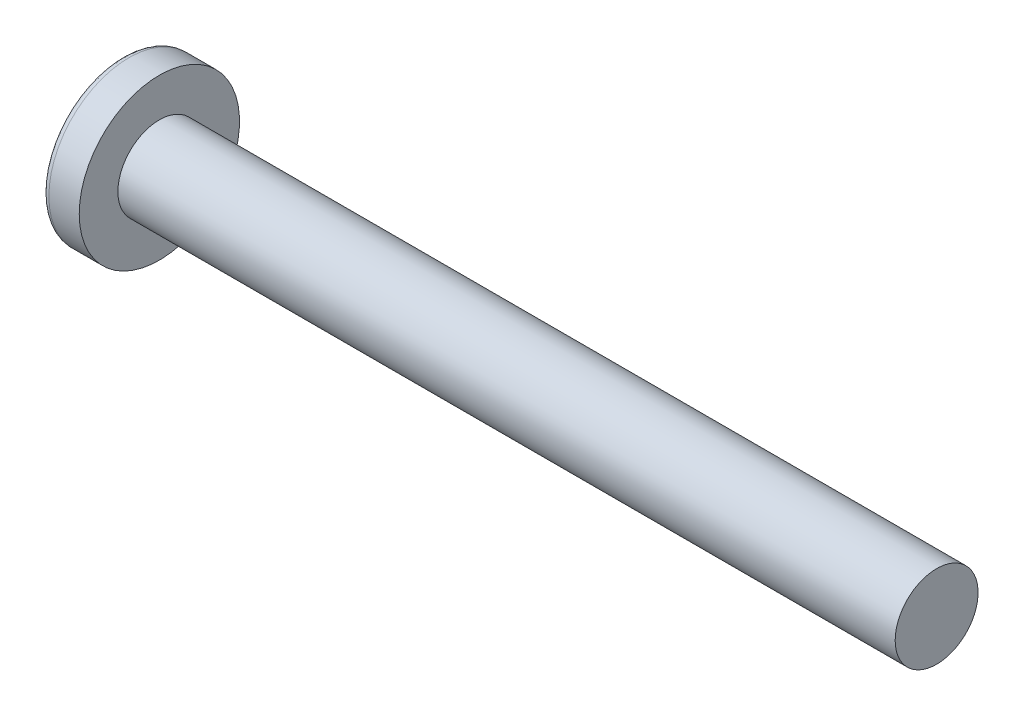
ISO-10303-21;
HEADER;
FILE_DESCRIPTION(('STEP AP214'),'2;1');
FILE_NAME('part.step','',(''),(''),'','','');
FILE_SCHEMA(('AUTOMOTIVE_DESIGN { 1 0 10303 214 1 1 1 1 }'));
ENDSEC;
DATA;
#1=APPLICATION_CONTEXT('core data for automotive mechanical design processes');
#2=APPLICATION_PROTOCOL_DEFINITION('international standard','automotive_design',2000,#1);
#3=PRODUCT_CONTEXT('',#1,'mechanical');
#4=PRODUCT('Part','Part','',(#3));
#5=PRODUCT_RELATED_PRODUCT_CATEGORY('part','',(#4));
#6=PRODUCT_DEFINITION_FORMATION('','',#4);
#7=PRODUCT_DEFINITION_CONTEXT('part definition',#1,'design');
#8=PRODUCT_DEFINITION('design','',#6,#7);
#9=PRODUCT_DEFINITION_SHAPE('','',#8);
#10=(LENGTH_UNIT() NAMED_UNIT(*) SI_UNIT(.MILLI.,.METRE.));
#11=(NAMED_UNIT(*) PLANE_ANGLE_UNIT() SI_UNIT($,.RADIAN.));
#12=(NAMED_UNIT(*) SI_UNIT($,.STERADIAN.) SOLID_ANGLE_UNIT());
#13=UNCERTAINTY_MEASURE_WITH_UNIT(LENGTH_MEASURE(1.E-05),#10,'distance_accuracy_value','');
#14=(GEOMETRIC_REPRESENTATION_CONTEXT(3) GLOBAL_UNCERTAINTY_ASSIGNED_CONTEXT((#13)) GLOBAL_UNIT_ASSIGNED_CONTEXT((#10,
#11,#12)) REPRESENTATION_CONTEXT('',''));
#15=CARTESIAN_POINT('',(0.,0.,0.));
#16=DIRECTION('',(0.,0.,1.));
#17=DIRECTION('',(1.,0.,0.));
#18=AXIS2_PLACEMENT_3D('',#15,#16,#17);
#19=CARTESIAN_POINT('',(2.4384,0.,0.));
#20=DIRECTION('',(-1.,0.,0.));
#21=DIRECTION('',(0.,1.,0.));
#22=AXIS2_PLACEMENT_3D('',#19,#20,#21);
#23=SPHERICAL_SURFACE('',#22,2.4384);
#24=CARTESIAN_POINT('',(0.456249612548632,0.,0.));
#25=DIRECTION('',(-1.,0.,0.));
#26=DIRECTION('',(0.,0.,1.));
#27=AXIS2_PLACEMENT_3D('',#24,#25,#26);
#28=CIRCLE('',#27,1.42016703296703);
#29=CARTESIAN_POINT('',(0.456249612548632,0.,1.42016703296703));
#30=VERTEX_POINT('',#29);
#31=EDGE_CURVE('E152',#30,#30,#28,.T.);
#32=ORIENTED_EDGE('',*,*,#31,.T.);
#33=EDGE_LOOP('',(#32));
#34=FACE_BOUND('',#33,.T.);
#35=CARTESIAN_POINT('',(2.42797639477701,-0.0720176360861456,0.));
#36=DIRECTION('',(-0.14324422473273,-0.989687370880683,0.));
#37=DIRECTION('',(0.989687370880683,-0.14324422473273,0.));
#38=AXIS2_PLACEMENT_3D('',#35,#36,#37);
#39=CIRCLE('',#38,2.43731396593601);
#40=CARTESIAN_POINT('',(0.159528631296444,0.256310329680775,0.828761039022779));
#41=VERTEX_POINT('',#40);
#42=CARTESIAN_POINT('',(0.0311879238102928,0.274885958395878,0.274885958395878));
#43=VERTEX_POINT('',#42);
#44=EDGE_CURVE('E183',#41,#43,#39,.T.);
#45=ORIENTED_EDGE('',*,*,#44,.F.);
#46=CARTESIAN_POINT('',(1.8850401359864,0.,-0.647005379462054));
#47=DIRECTION('',(0.649967502437297,0.,0.759962002849762));
#48=DIRECTION('',(0.759962002849762,0.,-0.649967502437297));
#49=AXIS2_PLACEMENT_3D('',#46,#47,#48);
#50=CIRCLE('',#49,2.28494452008052);
#51=CARTESIAN_POINT('',(0.159528631296444,-0.25631032968078,0.828761039022778));
#52=VERTEX_POINT('',#51);
#53=EDGE_CURVE('E148',#41,#52,#50,.T.);
#54=ORIENTED_EDGE('',*,*,#53,.T.);
#55=CARTESIAN_POINT('',(2.42797639477701,0.0720176360861442,0.));
#56=DIRECTION('',(-0.14324422473273,0.989687370880683,0.));
#57=DIRECTION('',(-0.989687370880683,-0.14324422473273,0.));
#58=AXIS2_PLACEMENT_3D('',#55,#56,#57);
#59=CIRCLE('',#58,2.43731396593601);
#60=CARTESIAN_POINT('',(0.0311879238102924,-0.274885958395879,0.274885958395878));
#61=VERTEX_POINT('',#60);
#62=EDGE_CURVE('E104',#61,#52,#59,.T.);
#63=ORIENTED_EDGE('',*,*,#62,.F.);
#64=CARTESIAN_POINT('',(2.42797639477701,0.,-0.0720176360861442));
#65=DIRECTION('',(-0.14324422473273,0.,-0.989687370880683));
#66=DIRECTION('',(-0.989687370880683,0.,0.14324422473273));
#67=AXIS2_PLACEMENT_3D('',#64,#65,#66);
#68=CIRCLE('',#67,2.43731396593601);
#69=CARTESIAN_POINT('',(0.159528631296443,-0.828761039022779,0.256310329680777));
#70=VERTEX_POINT('',#69);
#71=EDGE_CURVE('E129',#70,#61,#68,.T.);
#72=ORIENTED_EDGE('',*,*,#71,.F.);
#73=CARTESIAN_POINT('',(1.8850401359864,0.647005379462053,0.));
#74=DIRECTION('',(0.649967502437297,-0.759962002849762,0.));
#75=DIRECTION('',(0.759962002849762,0.649967502437297,0.));
#76=AXIS2_PLACEMENT_3D('',#73,#74,#75);
#77=CIRCLE('',#76,2.28494452008052);
#78=CARTESIAN_POINT('',(0.159528631296443,-0.828761039022779,-0.256310329680778));
#79=VERTEX_POINT('',#78);
#80=EDGE_CURVE('E137',#70,#79,#77,.T.);
#81=ORIENTED_EDGE('',*,*,#80,.T.);
#82=CARTESIAN_POINT('',(2.42797639477701,0.,0.0720176360861456));
#83=DIRECTION('',(-0.14324422473273,0.,0.989687370880683));
#84=DIRECTION('',(0.989687370880683,0.,0.14324422473273));
#85=AXIS2_PLACEMENT_3D('',#82,#83,#84);
#86=CIRCLE('',#85,2.43731396593601);
#87=CARTESIAN_POINT('',(0.0311879238102919,-0.274885958395877,-0.274885958395879));
#88=VERTEX_POINT('',#87);
#89=EDGE_CURVE('E47',#88,#79,#86,.T.);
#90=ORIENTED_EDGE('',*,*,#89,.F.);
#91=CARTESIAN_POINT('',(0.159528631296444,-0.256310329680774,-0.828761039022779));
#92=VERTEX_POINT('',#91);
#93=EDGE_CURVE('E190',#92,#88,#59,.T.);
#94=ORIENTED_EDGE('',*,*,#93,.F.);
#95=CARTESIAN_POINT('',(1.8850401359864,0.,0.647005379462054));
#96=DIRECTION('',(0.649967502437297,0.,-0.759962002849762));
#97=DIRECTION('',(-0.759962002849762,0.,-0.649967502437297));
#98=AXIS2_PLACEMENT_3D('',#95,#96,#97);
#99=CIRCLE('',#98,2.28494452008052);
#100=CARTESIAN_POINT('',(0.159528631296444,0.256310329680781,-0.828761039022777));
#101=VERTEX_POINT('',#100);
#102=EDGE_CURVE('E130',#92,#101,#99,.T.);
#103=ORIENTED_EDGE('',*,*,#102,.T.);
#104=CARTESIAN_POINT('',(0.0311879238102928,0.27488595839588,-0.274885958395879));
#105=VERTEX_POINT('',#104);
#106=EDGE_CURVE('E178',#105,#101,#39,.T.);
#107=ORIENTED_EDGE('',*,*,#106,.F.);
#108=CARTESIAN_POINT('',(0.159528631296445,0.828761039022778,-0.256310329680778));
#109=VERTEX_POINT('',#108);
#110=EDGE_CURVE('E40',#109,#105,#86,.T.);
#111=ORIENTED_EDGE('',*,*,#110,.F.);
#112=CARTESIAN_POINT('',(1.8850401359864,-0.647005379462055,0.));
#113=DIRECTION('',(0.649967502437297,0.759962002849762,0.));
#114=DIRECTION('',(-0.759962002849762,0.649967502437297,0.));
#115=AXIS2_PLACEMENT_3D('',#112,#113,#114);
#116=CIRCLE('',#115,2.28494452008053);
#117=CARTESIAN_POINT('',(0.159528631296444,0.828761039022778,0.256310329680777));
#118=VERTEX_POINT('',#117);
#119=EDGE_CURVE('E11',#109,#118,#116,.T.);
#120=ORIENTED_EDGE('',*,*,#119,.T.);
#121=EDGE_CURVE('E166',#43,#118,#68,.T.);
#122=ORIENTED_EDGE('',*,*,#121,.F.);
#123=EDGE_LOOP('',(#45,#54,#63,#72,#81,#90,#94,#103,#107,#111,#120,#122));
#124=FACE_BOUND('',#123,.T.);
#125=ADVANCED_FACE('F32',(#34,#124),#23,.T.);
#126=CARTESIAN_POINT('',(1.12854153846154,0.,-0.116058461538462));
#127=DIRECTION('',(-0.14324422473273,0.,0.989687370880683));
#128=DIRECTION('',(0.989687370880683,0.,0.14324422473273));
#129=AXIS2_PLACEMENT_3D('',#126,#127,#128);
#130=PLANE('',#129);
#131=ORIENTED_EDGE('',*,*,#110,.T.);
#132=DIRECTION('',(0.979687350511585,-0.141796853363519,0.141796853363519));
#133=VECTOR('',#132,1.);
#134=CARTESIAN_POINT('',(1.14466398343431,0.113724949766087,-0.113724949766086));
#135=LINE('',#134,#133);
#136=CARTESIAN_POINT('',(0.9652,0.1397,-0.139699999999999));
#137=VERTEX_POINT('',#136);
#138=EDGE_CURVE('E172',#105,#137,#135,.T.);
#139=ORIENTED_EDGE('',*,*,#138,.T.);
#140=DIRECTION('',(0.755405992689852,-0.646070914800531,0.109335077889321));
#141=VECTOR('',#140,1.);
#142=CARTESIAN_POINT('',(0.,0.9652,-0.2794));
#143=LINE('',#142,#141);
#144=EDGE_CURVE('E153',#109,#137,#143,.T.);
#145=ORIENTED_EDGE('',*,*,#144,.F.);
#146=EDGE_LOOP('',(#131,#139,#145));
#147=FACE_BOUND('',#146,.T.);
#148=ADVANCED_FACE('F171',(#147),#130,.T.);
#149=DIRECTION('',(0.755405992689852,0.646070914800531,0.109335077889321));
#150=VECTOR('',#149,1.);
#151=CARTESIAN_POINT('',(0.,-0.9652,-0.2794));
#152=LINE('',#151,#150);
#153=CARTESIAN_POINT('',(0.9652,-0.1397,-0.1397));
#154=VERTEX_POINT('',#153);
#155=EDGE_CURVE('E138',#79,#154,#152,.T.);
#156=ORIENTED_EDGE('',*,*,#155,.T.);
#157=DIRECTION('',(-0.979687350511585,-0.141796853363517,-0.141796853363519));
#158=VECTOR('',#157,1.);
#159=CARTESIAN_POINT('',(1.14466398343431,-0.113724949766086,-0.113724949766086));
#160=LINE('',#159,#158);
#161=EDGE_CURVE('E193',#154,#88,#160,.T.);
#162=ORIENTED_EDGE('',*,*,#161,.T.);
#163=ORIENTED_EDGE('',*,*,#89,.T.);
#164=EDGE_LOOP('',(#156,#162,#163));
#165=FACE_BOUND('',#164,.T.);
#166=ADVANCED_FACE('F208',(#165),#130,.T.);
#167=CARTESIAN_POINT('',(1.12854153846154,0.,0.116058461538462));
#168=DIRECTION('',(-0.14324422473273,0.,-0.989687370880683));
#169=DIRECTION('',(-0.989687370880683,0.,0.14324422473273));
#170=AXIS2_PLACEMENT_3D('',#167,#168,#169);
#171=PLANE('',#170);
#172=DIRECTION('',(0.755405992689852,-0.646070914800532,-0.10933507788932));
#173=VECTOR('',#172,1.);
#174=CARTESIAN_POINT('',(0.,0.9652,0.279399999999999));
#175=LINE('',#174,#173);
#176=CARTESIAN_POINT('',(0.9652,0.1397,0.1397));
#177=VERTEX_POINT('',#176);
#178=EDGE_CURVE('E209',#118,#177,#175,.T.);
#179=ORIENTED_EDGE('',*,*,#178,.T.);
#180=DIRECTION('',(-0.979687350511585,0.141796853363518,0.141796853363518));
#181=VECTOR('',#180,1.);
#182=CARTESIAN_POINT('',(1.14466398343431,0.113724949766086,0.113724949766086));
#183=LINE('',#182,#181);
#184=EDGE_CURVE('E187',#177,#43,#183,.T.);
#185=ORIENTED_EDGE('',*,*,#184,.T.);
#186=ORIENTED_EDGE('',*,*,#121,.T.);
#187=EDGE_LOOP('',(#179,#185,#186));
#188=FACE_BOUND('',#187,.T.);
#189=ADVANCED_FACE('F213',(#188),#171,.T.);
#190=ORIENTED_EDGE('',*,*,#71,.T.);
#191=DIRECTION('',(0.979687350511585,0.141796853363518,-0.141796853363518));
#192=VECTOR('',#191,1.);
#193=CARTESIAN_POINT('',(1.14466398343431,-0.113724949766087,0.113724949766086));
#194=LINE('',#193,#192);
#195=CARTESIAN_POINT('',(0.9652,-0.1397,0.139699999999999));
#196=VERTEX_POINT('',#195);
#197=EDGE_CURVE('E102',#61,#196,#194,.T.);
#198=ORIENTED_EDGE('',*,*,#197,.T.);
#199=DIRECTION('',(0.755405992689852,0.646070914800531,-0.10933507788932));
#200=VECTOR('',#199,1.);
#201=CARTESIAN_POINT('',(0.,-0.9652,0.279399999999999));
#202=LINE('',#201,#200);
#203=EDGE_CURVE('E127',#70,#196,#202,.T.);
#204=ORIENTED_EDGE('',*,*,#203,.F.);
#205=EDGE_LOOP('',(#190,#198,#204));
#206=FACE_BOUND('',#205,.T.);
#207=ADVANCED_FACE('F126',(#206),#171,.T.);
#208=CARTESIAN_POINT('',(-25.4,0.,0.));
#209=DIRECTION('',(-1.,0.,0.));
#210=DIRECTION('',(0.,0.,1.));
#211=AXIS2_PLACEMENT_3D('',#208,#209,#210);
#212=CYLINDRICAL_SURFACE('',#211,0.762);
#213=CARTESIAN_POINT('',(15.4051,0.,0.));
#214=DIRECTION('',(-1.,0.,0.));
#215=DIRECTION('',(0.,0.,1.));
#216=AXIS2_PLACEMENT_3D('',#213,#214,#215);
#217=CIRCLE('',#216,0.762);
#218=CARTESIAN_POINT('',(15.4051,0.,0.762));
#219=VERTEX_POINT('',#218);
#220=EDGE_CURVE('E149',#219,#219,#217,.T.);
#221=ORIENTED_EDGE('',*,*,#220,.T.);
#222=EDGE_LOOP('',(#221));
#223=FACE_BOUND('',#222,.T.);
#224=CARTESIAN_POINT('',(1.1176,0.,0.));
#225=DIRECTION('',(-1.,0.,0.));
#226=DIRECTION('',(0.,0.,1.));
#227=AXIS2_PLACEMENT_3D('',#224,#225,#226);
#228=CIRCLE('',#227,0.762);
#229=CARTESIAN_POINT('',(1.1176,0.,0.762));
#230=VERTEX_POINT('',#229);
#231=EDGE_CURVE('E162',#230,#230,#228,.T.);
#232=ORIENTED_EDGE('',*,*,#231,.F.);
#233=EDGE_LOOP('',(#232));
#234=FACE_BOUND('',#233,.T.);
#235=ADVANCED_FACE('F34',(#223,#234),#212,.T.);
#236=CARTESIAN_POINT('',(1.1176,0.762,0.));
#237=DIRECTION('',(-1.,0.,0.));
#238=DIRECTION('',(0.,0.,1.));
#239=AXIS2_PLACEMENT_3D('',#236,#237,#238);
#240=PLANE('',#239);
#241=CARTESIAN_POINT('',(1.1176,0.,0.));
#242=DIRECTION('',(-1.,0.,0.));
#243=DIRECTION('',(0.,0.,1.));
#244=AXIS2_PLACEMENT_3D('',#241,#242,#243);
#245=CIRCLE('',#244,1.4732);
#246=CARTESIAN_POINT('',(1.1176,0.,1.4732));
#247=VERTEX_POINT('',#246);
#248=EDGE_CURVE('E159',#247,#247,#245,.T.);
#249=ORIENTED_EDGE('',*,*,#248,.F.);
#250=EDGE_LOOP('',(#249));
#251=FACE_BOUND('',#250,.T.);
#252=ORIENTED_EDGE('',*,*,#231,.T.);
#253=EDGE_LOOP('',(#252));
#254=FACE_BOUND('',#253,.T.);
#255=ADVANCED_FACE('F241',(#251,#254),#240,.F.);
#256=CARTESIAN_POINT('',(-25.4,0.,0.));
#257=DIRECTION('',(-1.,0.,0.));
#258=DIRECTION('',(0.,0.,1.));
#259=AXIS2_PLACEMENT_3D('',#256,#257,#258);
#260=CYLINDRICAL_SURFACE('',#259,1.4732);
#261=ORIENTED_EDGE('',*,*,#248,.T.);
#262=EDGE_LOOP('',(#261));
#263=FACE_BOUND('',#262,.T.);
#264=CARTESIAN_POINT('',(0.559486611895057,0.,0.));
#265=DIRECTION('',(-1.,0.,0.));
#266=DIRECTION('',(0.,0.,1.));
#267=AXIS2_PLACEMENT_3D('',#264,#265,#266);
#268=CIRCLE('',#267,1.4732);
#269=CARTESIAN_POINT('',(0.559486611895057,0.,1.4732));
#270=VERTEX_POINT('',#269);
#271=EDGE_CURVE('E156',#270,#270,#268,.T.);
#272=ORIENTED_EDGE('',*,*,#271,.F.);
#273=EDGE_LOOP('',(#272));
#274=FACE_BOUND('',#273,.T.);
#275=ADVANCED_FACE('F238',(#263,#274),#260,.T.);
#276=CARTESIAN_POINT('',(0.559486611895057,0.,0.));
#277=DIRECTION('',(-1.,0.,0.));
#278=DIRECTION('',(0.,0.,1.));
#279=AXIS2_PLACEMENT_3D('',#276,#277,#278);
#280=TOROIDAL_SURFACE('',#279,1.3462,0.127000000000001);
#281=ORIENTED_EDGE('',*,*,#271,.T.);
#282=EDGE_LOOP('',(#281));
#283=FACE_BOUND('',#282,.T.);
#284=ORIENTED_EDGE('',*,*,#31,.F.);
#285=EDGE_LOOP('',(#284));
#286=FACE_BOUND('',#285,.T.);
#287=ADVANCED_FACE('F235',(#283,#286),#280,.T.);
#288=CARTESIAN_POINT('',(15.4051,0.762,0.));
#289=DIRECTION('',(1.,0.,0.));
#290=DIRECTION('',(0.,0.,-1.));
#291=AXIS2_PLACEMENT_3D('',#288,#289,#290);
#292=PLANE('',#291);
#293=ORIENTED_EDGE('',*,*,#220,.F.);
#294=EDGE_LOOP('',(#293));
#295=FACE_BOUND('',#294,.T.);
#296=ADVANCED_FACE('F233',(#295),#292,.T.);
#297=CARTESIAN_POINT('',(0.9652,0.1397,0.1397));
#298=DIRECTION('',(0.649967502437297,0.759962002849762,0.));
#299=DIRECTION('',(-0.759962002849762,0.649967502437297,0.));
#300=AXIS2_PLACEMENT_3D('',#297,#298,#299);
#301=PLANE('',#300);
#302=ORIENTED_EDGE('',*,*,#144,.T.);
#303=DIRECTION('',(0.,0.,-1.));
#304=VECTOR('',#303,1.);
#305=CARTESIAN_POINT('',(0.9652,0.1397,0.1397));
#306=LINE('',#305,#304);
#307=EDGE_CURVE('E120',#177,#137,#306,.T.);
#308=ORIENTED_EDGE('',*,*,#307,.F.);
#309=ORIENTED_EDGE('',*,*,#178,.F.);
#310=ORIENTED_EDGE('',*,*,#119,.F.);
#311=EDGE_LOOP('',(#302,#308,#309,#310));
#312=FACE_BOUND('',#311,.T.);
#313=ADVANCED_FACE('F212',(#312),#301,.F.);
#314=CARTESIAN_POINT('',(0.9652,-0.1397,-0.1397));
#315=DIRECTION('',(0.649967502437297,-0.759962002849762,0.));
#316=DIRECTION('',(0.759962002849762,0.649967502437297,0.));
#317=AXIS2_PLACEMENT_3D('',#314,#315,#316);
#318=PLANE('',#317);
#319=ORIENTED_EDGE('',*,*,#203,.T.);
#320=DIRECTION('',(0.,0.,1.));
#321=VECTOR('',#320,1.);
#322=CARTESIAN_POINT('',(0.9652,-0.1397,-0.1397));
#323=LINE('',#322,#321);
#324=EDGE_CURVE('E119',#154,#196,#323,.T.);
#325=ORIENTED_EDGE('',*,*,#324,.F.);
#326=ORIENTED_EDGE('',*,*,#155,.F.);
#327=ORIENTED_EDGE('',*,*,#80,.F.);
#328=EDGE_LOOP('',(#319,#325,#326,#327));
#329=FACE_BOUND('',#328,.T.);
#330=ADVANCED_FACE('F134',(#329),#318,.F.);
#331=CARTESIAN_POINT('',(0.9652,0.1397,-0.1397));
#332=DIRECTION('',(-1.,0.,0.));
#333=DIRECTION('',(0.,0.,1.));
#334=AXIS2_PLACEMENT_3D('',#331,#332,#333);
#335=PLANE('',#334);
#336=DIRECTION('',(0.,1.,0.));
#337=VECTOR('',#336,1.);
#338=CARTESIAN_POINT('',(0.9652,-0.1397,-0.1397));
#339=LINE('',#338,#337);
#340=EDGE_CURVE('E142',#154,#137,#339,.T.);
#341=ORIENTED_EDGE('',*,*,#340,.F.);
#342=ORIENTED_EDGE('',*,*,#324,.T.);
#343=DIRECTION('',(0.,-1.,0.));
#344=VECTOR('',#343,1.);
#345=CARTESIAN_POINT('',(0.9652,0.1397,0.1397));
#346=LINE('',#345,#344);
#347=EDGE_CURVE('E111',#177,#196,#346,.T.);
#348=ORIENTED_EDGE('',*,*,#347,.F.);
#349=ORIENTED_EDGE('',*,*,#307,.T.);
#350=EDGE_LOOP('',(#341,#342,#348,#349));
#351=FACE_BOUND('',#350,.T.);
#352=ADVANCED_FACE('F140',(#351),#335,.T.);
#353=CARTESIAN_POINT('',(0.9652,0.1397,-0.139699999999999));
#354=DIRECTION('',(0.649967502437297,0.,-0.759962002849762));
#355=DIRECTION('',(0.759962002849762,0.,0.649967502437297));
#356=AXIS2_PLACEMENT_3D('',#353,#354,#355);
#357=PLANE('',#356);
#358=DIRECTION('',(0.755405992689852,0.109335077889318,0.646070914800532));
#359=VECTOR('',#358,1.);
#360=CARTESIAN_POINT('',(0.,-0.279399999999996,-0.965200000000001));
#361=LINE('',#360,#359);
#362=EDGE_CURVE('E198',#92,#154,#361,.T.);
#363=ORIENTED_EDGE('',*,*,#362,.T.);
#364=ORIENTED_EDGE('',*,*,#340,.T.);
#365=DIRECTION('',(0.755405992689852,-0.109335077889323,0.646070914800531));
#366=VECTOR('',#365,1.);
#367=CARTESIAN_POINT('',(0.,0.279400000000003,-0.965199999999999));
#368=LINE('',#367,#366);
#369=EDGE_CURVE('E108',#101,#137,#368,.T.);
#370=ORIENTED_EDGE('',*,*,#369,.F.);
#371=ORIENTED_EDGE('',*,*,#102,.F.);
#372=EDGE_LOOP('',(#363,#364,#370,#371));
#373=FACE_BOUND('',#372,.T.);
#374=ADVANCED_FACE('F203',(#373),#357,.F.);
#375=CARTESIAN_POINT('',(1.12854153846154,-0.116058461538462,0.));
#376=DIRECTION('',(-0.14324422473273,0.989687370880683,0.));
#377=DIRECTION('',(-0.989687370880683,-0.14324422473273,0.));
#378=AXIS2_PLACEMENT_3D('',#375,#376,#377);
#379=PLANE('',#378);
#380=ORIENTED_EDGE('',*,*,#93,.T.);
#381=ORIENTED_EDGE('',*,*,#161,.F.);
#382=ORIENTED_EDGE('',*,*,#362,.F.);
#383=EDGE_LOOP('',(#380,#381,#382));
#384=FACE_BOUND('',#383,.T.);
#385=ADVANCED_FACE('F207',(#384),#379,.T.);
#386=CARTESIAN_POINT('',(1.12854153846154,0.116058461538462,0.));
#387=DIRECTION('',(-0.14324422473273,-0.989687370880683,0.));
#388=DIRECTION('',(0.989687370880683,-0.14324422473273,0.));
#389=AXIS2_PLACEMENT_3D('',#386,#387,#388);
#390=PLANE('',#389);
#391=ORIENTED_EDGE('',*,*,#106,.T.);
#392=ORIENTED_EDGE('',*,*,#369,.T.);
#393=ORIENTED_EDGE('',*,*,#138,.F.);
#394=EDGE_LOOP('',(#391,#392,#393));
#395=FACE_BOUND('',#394,.T.);
#396=ADVANCED_FACE('F201',(#395),#390,.T.);
#397=CARTESIAN_POINT('',(0.9652,-0.1397,0.139699999999999));
#398=DIRECTION('',(0.649967502437297,0.,0.759962002849762));
#399=DIRECTION('',(-0.759962002849762,0.,0.649967502437297));
#400=AXIS2_PLACEMENT_3D('',#397,#398,#399);
#401=PLANE('',#400);
#402=DIRECTION('',(0.755405992689852,-0.109335077889318,-0.646070914800532));
#403=VECTOR('',#402,1.);
#404=CARTESIAN_POINT('',(0.,0.279399999999997,0.965200000000001));
#405=LINE('',#404,#403);
#406=EDGE_CURVE('E107',#41,#177,#405,.T.);
#407=ORIENTED_EDGE('',*,*,#406,.T.);
#408=ORIENTED_EDGE('',*,*,#347,.T.);
#409=DIRECTION('',(0.755405992689852,0.109335077889322,-0.646070914800531));
#410=VECTOR('',#409,1.);
#411=CARTESIAN_POINT('',(0.,-0.279400000000002,0.965199999999999));
#412=LINE('',#411,#410);
#413=EDGE_CURVE('E98',#52,#196,#412,.T.);
#414=ORIENTED_EDGE('',*,*,#413,.F.);
#415=ORIENTED_EDGE('',*,*,#53,.F.);
#416=EDGE_LOOP('',(#407,#408,#414,#415));
#417=FACE_BOUND('',#416,.T.);
#418=ADVANCED_FACE('F112',(#417),#401,.F.);
#419=ORIENTED_EDGE('',*,*,#44,.T.);
#420=ORIENTED_EDGE('',*,*,#184,.F.);
#421=ORIENTED_EDGE('',*,*,#406,.F.);
#422=EDGE_LOOP('',(#419,#420,#421));
#423=FACE_BOUND('',#422,.T.);
#424=ADVANCED_FACE('F214',(#423),#390,.T.);
#425=ORIENTED_EDGE('',*,*,#62,.T.);
#426=ORIENTED_EDGE('',*,*,#413,.T.);
#427=ORIENTED_EDGE('',*,*,#197,.F.);
#428=EDGE_LOOP('',(#425,#426,#427));
#429=FACE_BOUND('',#428,.T.);
#430=ADVANCED_FACE('F100',(#429),#379,.T.);
#431=CLOSED_SHELL('',(#125,#148,#166,#189,#207,#235,#255,#275,#287,#296,#313,#330,#352,#374,
#385,#396,#418,#424,#430));
#432=MANIFOLD_SOLID_BREP('B2',#431);
#433=ADVANCED_BREP_SHAPE_REPRESENTATION('',(#18,#432),#14);
#434=SHAPE_DEFINITION_REPRESENTATION(#9,#433);
ENDSEC;
END-ISO-10303-21;
